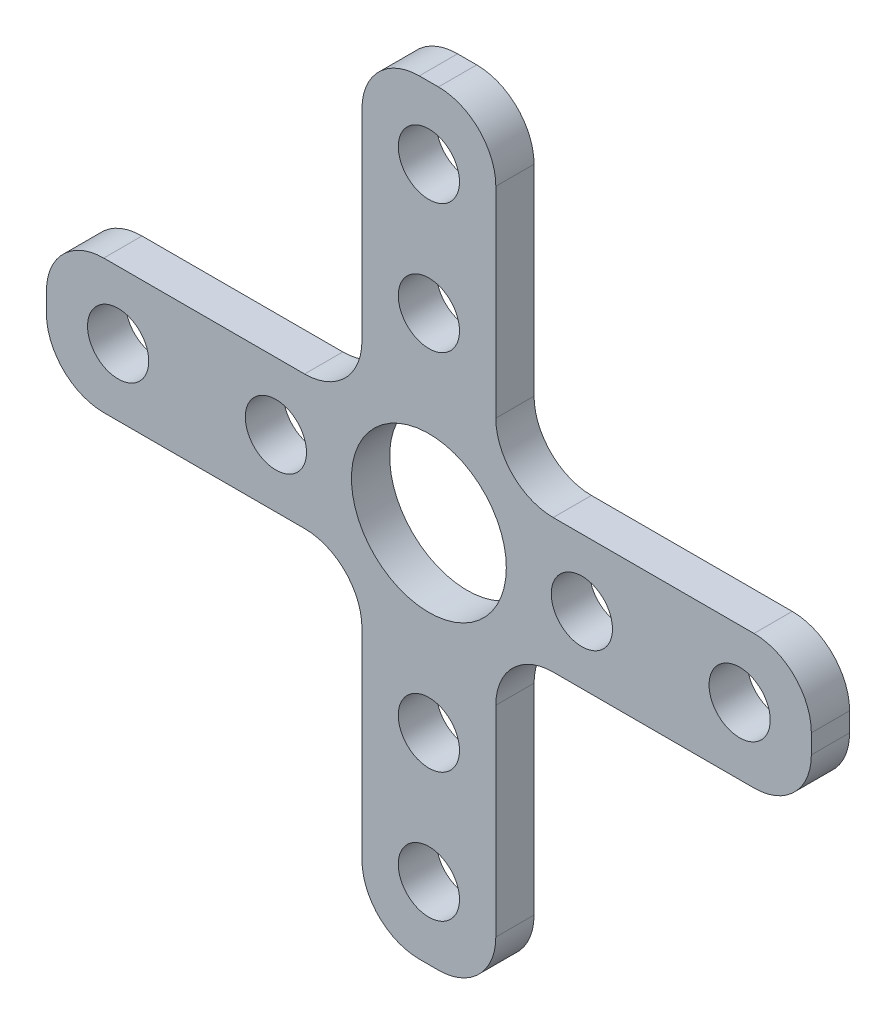
ISO-10303-21;
HEADER;
FILE_DESCRIPTION(('STEP AP214'),'2;1');
FILE_NAME('part.step','',(''),(''),'','','');
FILE_SCHEMA(('AUTOMOTIVE_DESIGN { 1 0 10303 214 1 1 1 1 }'));
ENDSEC;
DATA;
#1=APPLICATION_CONTEXT('core data for automotive mechanical design processes');
#2=APPLICATION_PROTOCOL_DEFINITION('international standard','automotive_design',2000,#1);
#3=PRODUCT_CONTEXT('',#1,'mechanical');
#4=PRODUCT('Part','Part','',(#3));
#5=PRODUCT_RELATED_PRODUCT_CATEGORY('part','',(#4));
#6=PRODUCT_DEFINITION_FORMATION('','',#4);
#7=PRODUCT_DEFINITION_CONTEXT('part definition',#1,'design');
#8=PRODUCT_DEFINITION('design','',#6,#7);
#9=PRODUCT_DEFINITION_SHAPE('','',#8);
#10=(LENGTH_UNIT() NAMED_UNIT(*) SI_UNIT(.MILLI.,.METRE.));
#11=(NAMED_UNIT(*) PLANE_ANGLE_UNIT() SI_UNIT($,.RADIAN.));
#12=(NAMED_UNIT(*) SI_UNIT($,.STERADIAN.) SOLID_ANGLE_UNIT());
#13=UNCERTAINTY_MEASURE_WITH_UNIT(LENGTH_MEASURE(1.E-05),#10,'distance_accuracy_value','');
#14=(GEOMETRIC_REPRESENTATION_CONTEXT(3) GLOBAL_UNCERTAINTY_ASSIGNED_CONTEXT((#13)) GLOBAL_UNIT_ASSIGNED_CONTEXT((#10,
#11,#12)) REPRESENTATION_CONTEXT('',''));
#15=CARTESIAN_POINT('',(0.,0.,0.));
#16=DIRECTION('',(0.,0.,1.));
#17=DIRECTION('',(1.,0.,0.));
#18=AXIS2_PLACEMENT_3D('',#15,#16,#17);
#19=CARTESIAN_POINT('',(0.,0.,1.));
#20=DIRECTION('',(0.,0.,1.));
#21=DIRECTION('',(1.,0.,0.));
#22=AXIS2_PLACEMENT_3D('',#19,#20,#21);
#23=PLANE('',#22);
#24=CARTESIAN_POINT('',(0.,-9.5,1.));
#25=DIRECTION('',(0.,0.,1.));
#26=DIRECTION('',(1.,0.,0.));
#27=AXIS2_PLACEMENT_3D('',#24,#25,#26);
#28=CIRCLE('',#27,1.6);
#29=CARTESIAN_POINT('',(1.6,-9.5,1.));
#30=VERTEX_POINT('',#29);
#31=EDGE_CURVE('E532',#30,#30,#28,.T.);
#32=ORIENTED_EDGE('',*,*,#31,.F.);
#33=EDGE_LOOP('',(#32));
#34=FACE_BOUND('',#33,.T.);
#35=CARTESIAN_POINT('',(0.,9.5,1.));
#36=DIRECTION('',(0.,0.,1.));
#37=DIRECTION('',(1.,0.,0.));
#38=AXIS2_PLACEMENT_3D('',#35,#36,#37);
#39=CIRCLE('',#38,1.6);
#40=CARTESIAN_POINT('',(1.6,9.5,1.));
#41=VERTEX_POINT('',#40);
#42=EDGE_CURVE('E516',#41,#41,#39,.T.);
#43=ORIENTED_EDGE('',*,*,#42,.F.);
#44=EDGE_LOOP('',(#43));
#45=FACE_BOUND('',#44,.T.);
#46=CARTESIAN_POINT('',(0.,-16.25,1.));
#47=DIRECTION('',(0.,0.,1.));
#48=DIRECTION('',(1.,0.,0.));
#49=AXIS2_PLACEMENT_3D('',#46,#47,#48);
#50=CIRCLE('',#49,1.6);
#51=CARTESIAN_POINT('',(1.6,-16.25,1.));
#52=VERTEX_POINT('',#51);
#53=EDGE_CURVE('E500',#52,#52,#50,.T.);
#54=ORIENTED_EDGE('',*,*,#53,.F.);
#55=EDGE_LOOP('',(#54));
#56=FACE_BOUND('',#55,.T.);
#57=CARTESIAN_POINT('',(8.,0.,1.));
#58=DIRECTION('',(0.,0.,1.));
#59=DIRECTION('',(1.,0.,0.));
#60=AXIS2_PLACEMENT_3D('',#57,#58,#59);
#61=CIRCLE('',#60,1.6);
#62=CARTESIAN_POINT('',(9.6,0.,1.));
#63=VERTEX_POINT('',#62);
#64=EDGE_CURVE('E484',#63,#63,#61,.T.);
#65=ORIENTED_EDGE('',*,*,#64,.F.);
#66=EDGE_LOOP('',(#65));
#67=FACE_BOUND('',#66,.T.);
#68=DIRECTION('',(-1.,0.,0.));
#69=VECTOR('',#68,1.);
#70=CARTESIAN_POINT('',(-20.,3.5,1.));
#71=LINE('',#70,#69);
#72=CARTESIAN_POINT('',(-6.5,3.5,1.));
#73=VERTEX_POINT('',#72);
#74=CARTESIAN_POINT('',(-17.,3.5,1.));
#75=VERTEX_POINT('',#74);
#76=EDGE_CURVE('E403',#73,#75,#71,.T.);
#77=ORIENTED_EDGE('',*,*,#76,.T.);
#78=CARTESIAN_POINT('',(-17.,0.499999999999999,1.));
#79=DIRECTION('',(0.,0.,1.));
#80=DIRECTION('',(1.,0.,0.));
#81=AXIS2_PLACEMENT_3D('',#78,#79,#80);
#82=CIRCLE('',#81,3.);
#83=CARTESIAN_POINT('',(-20.,0.499999999999999,1.));
#84=VERTEX_POINT('',#83);
#85=EDGE_CURVE('E297',#75,#84,#82,.T.);
#86=ORIENTED_EDGE('',*,*,#85,.T.);
#87=DIRECTION('',(0.,-1.,0.));
#88=VECTOR('',#87,1.);
#89=CARTESIAN_POINT('',(-20.,-3.5,1.));
#90=LINE('',#89,#88);
#91=CARTESIAN_POINT('',(-20.,-0.500000000000001,1.));
#92=VERTEX_POINT('',#91);
#93=EDGE_CURVE('E222',#84,#92,#90,.T.);
#94=ORIENTED_EDGE('',*,*,#93,.T.);
#95=CARTESIAN_POINT('',(-17.,-0.500000000000001,1.));
#96=DIRECTION('',(0.,0.,1.));
#97=DIRECTION('',(1.,0.,0.));
#98=AXIS2_PLACEMENT_3D('',#95,#96,#97);
#99=CIRCLE('',#98,3.);
#100=CARTESIAN_POINT('',(-17.,-3.5,1.));
#101=VERTEX_POINT('',#100);
#102=EDGE_CURVE('E294',#92,#101,#99,.T.);
#103=ORIENTED_EDGE('',*,*,#102,.T.);
#104=DIRECTION('',(1.,0.,0.));
#105=VECTOR('',#104,1.);
#106=CARTESIAN_POINT('',(-20.,-3.5,1.));
#107=LINE('',#106,#105);
#108=CARTESIAN_POINT('',(-6.5,-3.5,1.));
#109=VERTEX_POINT('',#108);
#110=EDGE_CURVE('E411',#101,#109,#107,.T.);
#111=ORIENTED_EDGE('',*,*,#110,.T.);
#112=CARTESIAN_POINT('',(-6.5,-6.5,1.));
#113=DIRECTION('',(0.,0.,1.));
#114=DIRECTION('',(1.,0.,0.));
#115=AXIS2_PLACEMENT_3D('',#112,#113,#114);
#116=CIRCLE('',#115,3.);
#117=CARTESIAN_POINT('',(-3.5,-6.5,1.));
#118=VERTEX_POINT('',#117);
#119=EDGE_CURVE('E372',#109,#118,#116,.F.);
#120=ORIENTED_EDGE('',*,*,#119,.T.);
#121=DIRECTION('',(0.,-1.,0.));
#122=VECTOR('',#121,1.);
#123=CARTESIAN_POINT('',(-3.5,-3.5,1.));
#124=LINE('',#123,#122);
#125=CARTESIAN_POINT('',(-3.5,-17.,1.));
#126=VERTEX_POINT('',#125);
#127=EDGE_CURVE('E420',#118,#126,#124,.T.);
#128=ORIENTED_EDGE('',*,*,#127,.T.);
#129=CARTESIAN_POINT('',(-0.499999999999997,-17.,1.));
#130=DIRECTION('',(0.,0.,1.));
#131=DIRECTION('',(1.,0.,0.));
#132=AXIS2_PLACEMENT_3D('',#129,#130,#131);
#133=CIRCLE('',#132,3.);
#134=CARTESIAN_POINT('',(-0.499999999999997,-20.,1.));
#135=VERTEX_POINT('',#134);
#136=EDGE_CURVE('E61',#126,#135,#133,.T.);
#137=ORIENTED_EDGE('',*,*,#136,.T.);
#138=DIRECTION('',(1.,0.,0.));
#139=VECTOR('',#138,1.);
#140=CARTESIAN_POINT('',(-3.5,-20.,1.));
#141=LINE('',#140,#139);
#142=CARTESIAN_POINT('',(0.500000000000003,-20.,1.));
#143=VERTEX_POINT('',#142);
#144=EDGE_CURVE('E251',#135,#143,#141,.T.);
#145=ORIENTED_EDGE('',*,*,#144,.T.);
#146=CARTESIAN_POINT('',(0.500000000000003,-17.,1.));
#147=DIRECTION('',(0.,0.,1.));
#148=DIRECTION('',(1.,0.,0.));
#149=AXIS2_PLACEMENT_3D('',#146,#147,#148);
#150=CIRCLE('',#149,3.);
#151=CARTESIAN_POINT('',(3.5,-17.,1.));
#152=VERTEX_POINT('',#151);
#153=EDGE_CURVE('E289',#143,#152,#150,.T.);
#154=ORIENTED_EDGE('',*,*,#153,.T.);
#155=DIRECTION('',(0.,1.,0.));
#156=VECTOR('',#155,1.);
#157=CARTESIAN_POINT('',(3.5,-3.5,1.));
#158=LINE('',#157,#156);
#159=CARTESIAN_POINT('',(3.5,-6.5,1.));
#160=VERTEX_POINT('',#159);
#161=EDGE_CURVE('E249',#152,#160,#158,.T.);
#162=ORIENTED_EDGE('',*,*,#161,.T.);
#163=CARTESIAN_POINT('',(6.5,-6.5,1.));
#164=DIRECTION('',(0.,0.,1.));
#165=DIRECTION('',(1.,0.,0.));
#166=AXIS2_PLACEMENT_3D('',#163,#164,#165);
#167=CIRCLE('',#166,3.);
#168=CARTESIAN_POINT('',(6.5,-3.5,1.));
#169=VERTEX_POINT('',#168);
#170=EDGE_CURVE('E378',#160,#169,#167,.F.);
#171=ORIENTED_EDGE('',*,*,#170,.T.);
#172=DIRECTION('',(1.,0.,0.));
#173=VECTOR('',#172,1.);
#174=CARTESIAN_POINT('',(3.5,-3.5,1.));
#175=LINE('',#174,#173);
#176=CARTESIAN_POINT('',(17.,-3.5,1.));
#177=VERTEX_POINT('',#176);
#178=EDGE_CURVE('E473',#169,#177,#175,.T.);
#179=ORIENTED_EDGE('',*,*,#178,.T.);
#180=CARTESIAN_POINT('',(17.,-0.500000000000001,1.));
#181=DIRECTION('',(0.,0.,1.));
#182=DIRECTION('',(1.,0.,0.));
#183=AXIS2_PLACEMENT_3D('',#180,#181,#182);
#184=CIRCLE('',#183,3.);
#185=CARTESIAN_POINT('',(20.,-0.500000000000001,1.));
#186=VERTEX_POINT('',#185);
#187=EDGE_CURVE('E286',#177,#186,#184,.T.);
#188=ORIENTED_EDGE('',*,*,#187,.T.);
#189=DIRECTION('',(0.,1.,0.));
#190=VECTOR('',#189,1.);
#191=CARTESIAN_POINT('',(20.,-3.5,1.));
#192=LINE('',#191,#190);
#193=CARTESIAN_POINT('',(20.,0.499999999999999,1.));
#194=VERTEX_POINT('',#193);
#195=EDGE_CURVE('E469',#186,#194,#192,.T.);
#196=ORIENTED_EDGE('',*,*,#195,.T.);
#197=CARTESIAN_POINT('',(17.,0.499999999999999,1.));
#198=DIRECTION('',(0.,0.,1.));
#199=DIRECTION('',(1.,0.,0.));
#200=AXIS2_PLACEMENT_3D('',#197,#198,#199);
#201=CIRCLE('',#200,3.);
#202=CARTESIAN_POINT('',(17.,3.5,1.));
#203=VERTEX_POINT('',#202);
#204=EDGE_CURVE('E283',#194,#203,#201,.T.);
#205=ORIENTED_EDGE('',*,*,#204,.T.);
#206=DIRECTION('',(-1.,0.,0.));
#207=VECTOR('',#206,1.);
#208=CARTESIAN_POINT('',(3.5,3.5,1.));
#209=LINE('',#208,#207);
#210=CARTESIAN_POINT('',(6.5,3.5,1.));
#211=VERTEX_POINT('',#210);
#212=EDGE_CURVE('E463',#203,#211,#209,.T.);
#213=ORIENTED_EDGE('',*,*,#212,.T.);
#214=CARTESIAN_POINT('',(6.5,6.5,1.));
#215=DIRECTION('',(0.,0.,1.));
#216=DIRECTION('',(1.,0.,0.));
#217=AXIS2_PLACEMENT_3D('',#214,#215,#216);
#218=CIRCLE('',#217,3.);
#219=CARTESIAN_POINT('',(3.5,6.5,1.));
#220=VERTEX_POINT('',#219);
#221=EDGE_CURVE('E384',#211,#220,#218,.F.);
#222=ORIENTED_EDGE('',*,*,#221,.T.);
#223=DIRECTION('',(0.,1.,0.));
#224=VECTOR('',#223,1.);
#225=CARTESIAN_POINT('',(3.5,20.,1.));
#226=LINE('',#225,#224);
#227=CARTESIAN_POINT('',(3.5,17.,1.));
#228=VERTEX_POINT('',#227);
#229=EDGE_CURVE('E461',#220,#228,#226,.T.);
#230=ORIENTED_EDGE('',*,*,#229,.T.);
#231=CARTESIAN_POINT('',(0.499999999999999,17.,1.));
#232=DIRECTION('',(0.,0.,1.));
#233=DIRECTION('',(1.,0.,0.));
#234=AXIS2_PLACEMENT_3D('',#231,#232,#233);
#235=CIRCLE('',#234,3.);
#236=CARTESIAN_POINT('',(0.499999999999999,20.,1.));
#237=VERTEX_POINT('',#236);
#238=EDGE_CURVE('E280',#228,#237,#235,.T.);
#239=ORIENTED_EDGE('',*,*,#238,.T.);
#240=DIRECTION('',(-1.,0.,0.));
#241=VECTOR('',#240,1.);
#242=CARTESIAN_POINT('',(-3.5,20.,1.));
#243=LINE('',#242,#241);
#244=CARTESIAN_POINT('',(-0.500000000000001,20.,1.));
#245=VERTEX_POINT('',#244);
#246=EDGE_CURVE('E413',#237,#245,#243,.T.);
#247=ORIENTED_EDGE('',*,*,#246,.T.);
#248=CARTESIAN_POINT('',(-0.500000000000001,17.,1.));
#249=DIRECTION('',(0.,0.,1.));
#250=DIRECTION('',(1.,0.,0.));
#251=AXIS2_PLACEMENT_3D('',#248,#249,#250);
#252=CIRCLE('',#251,3.);
#253=CARTESIAN_POINT('',(-3.5,17.,1.));
#254=VERTEX_POINT('',#253);
#255=EDGE_CURVE('E277',#245,#254,#252,.T.);
#256=ORIENTED_EDGE('',*,*,#255,.T.);
#257=DIRECTION('',(0.,-1.,0.));
#258=VECTOR('',#257,1.);
#259=CARTESIAN_POINT('',(-3.5,20.,1.));
#260=LINE('',#259,#258);
#261=CARTESIAN_POINT('',(-3.5,6.5,1.));
#262=VERTEX_POINT('',#261);
#263=EDGE_CURVE('E404',#254,#262,#260,.T.);
#264=ORIENTED_EDGE('',*,*,#263,.T.);
#265=CARTESIAN_POINT('',(-6.5,6.5,1.));
#266=DIRECTION('',(0.,0.,1.));
#267=DIRECTION('',(1.,0.,0.));
#268=AXIS2_PLACEMENT_3D('',#265,#266,#267);
#269=CIRCLE('',#268,3.);
#270=EDGE_CURVE('E11',#262,#73,#269,.F.);
#271=ORIENTED_EDGE('',*,*,#270,.T.);
#272=EDGE_LOOP('',(#77,#86,#94,#103,#111,#120,#128,#137,#145,#154,#162,#171,#179,#188,#196,#205,
#213,#222,#230,#239,#247,#256,#264,#271));
#273=FACE_BOUND('',#272,.T.);
#274=CARTESIAN_POINT('',(-8.,0.,1.));
#275=DIRECTION('',(0.,0.,1.));
#276=DIRECTION('',(1.,0.,0.));
#277=AXIS2_PLACEMENT_3D('',#274,#275,#276);
#278=CIRCLE('',#277,1.6);
#279=CARTESIAN_POINT('',(-6.4,0.,1.));
#280=VERTEX_POINT('',#279);
#281=EDGE_CURVE('E430',#280,#280,#278,.T.);
#282=ORIENTED_EDGE('',*,*,#281,.F.);
#283=EDGE_LOOP('',(#282));
#284=FACE_BOUND('',#283,.T.);
#285=CARTESIAN_POINT('',(0.,16.25,1.));
#286=DIRECTION('',(0.,0.,1.));
#287=DIRECTION('',(1.,0.,0.));
#288=AXIS2_PLACEMENT_3D('',#285,#286,#287);
#289=CIRCLE('',#288,1.6);
#290=CARTESIAN_POINT('',(1.6,16.25,1.));
#291=VERTEX_POINT('',#290);
#292=EDGE_CURVE('E492',#291,#291,#289,.T.);
#293=ORIENTED_EDGE('',*,*,#292,.F.);
#294=EDGE_LOOP('',(#293));
#295=FACE_BOUND('',#294,.T.);
#296=CARTESIAN_POINT('',(0.,0.,1.));
#297=DIRECTION('',(0.,0.,1.));
#298=DIRECTION('',(1.,0.,0.));
#299=AXIS2_PLACEMENT_3D('',#296,#297,#298);
#300=CIRCLE('',#299,4.05);
#301=CARTESIAN_POINT('',(4.05,0.,1.));
#302=VERTEX_POINT('',#301);
#303=EDGE_CURVE('E508',#302,#302,#300,.T.);
#304=ORIENTED_EDGE('',*,*,#303,.F.);
#305=EDGE_LOOP('',(#304));
#306=FACE_BOUND('',#305,.T.);
#307=CARTESIAN_POINT('',(-16.25,0.,1.));
#308=DIRECTION('',(0.,0.,1.));
#309=DIRECTION('',(1.,0.,0.));
#310=AXIS2_PLACEMENT_3D('',#307,#308,#309);
#311=CIRCLE('',#310,1.6);
#312=CARTESIAN_POINT('',(-14.65,0.,1.));
#313=VERTEX_POINT('',#312);
#314=EDGE_CURVE('E524',#313,#313,#311,.T.);
#315=ORIENTED_EDGE('',*,*,#314,.F.);
#316=EDGE_LOOP('',(#315));
#317=FACE_BOUND('',#316,.T.);
#318=CARTESIAN_POINT('',(16.25,0.,1.));
#319=DIRECTION('',(0.,0.,1.));
#320=DIRECTION('',(1.,0.,0.));
#321=AXIS2_PLACEMENT_3D('',#318,#319,#320);
#322=CIRCLE('',#321,1.6);
#323=CARTESIAN_POINT('',(17.85,0.,1.));
#324=VERTEX_POINT('',#323);
#325=EDGE_CURVE('E540',#324,#324,#322,.T.);
#326=ORIENTED_EDGE('',*,*,#325,.F.);
#327=EDGE_LOOP('',(#326));
#328=FACE_BOUND('',#327,.T.);
#329=ADVANCED_FACE('F38',(#34,#45,#56,#67,#273,#284,#295,#306,#317,#328),#23,.T.);
#330=CARTESIAN_POINT('',(0.,0.,-1.));
#331=DIRECTION('',(0.,0.,1.));
#332=DIRECTION('',(1.,0.,0.));
#333=AXIS2_PLACEMENT_3D('',#330,#331,#332);
#334=PLANE('',#333);
#335=DIRECTION('',(0.,-1.,0.));
#336=VECTOR('',#335,1.);
#337=CARTESIAN_POINT('',(-20.,-3.5,-1.));
#338=LINE('',#337,#336);
#339=CARTESIAN_POINT('',(-20.,0.499999999999999,-1.));
#340=VERTEX_POINT('',#339);
#341=CARTESIAN_POINT('',(-20.,-0.500000000000001,-1.));
#342=VERTEX_POINT('',#341);
#343=EDGE_CURVE('E219',#340,#342,#338,.T.);
#344=ORIENTED_EDGE('',*,*,#343,.F.);
#345=CARTESIAN_POINT('',(-17.,0.499999999999999,-1.));
#346=DIRECTION('',(0.,0.,1.));
#347=DIRECTION('',(1.,0.,0.));
#348=AXIS2_PLACEMENT_3D('',#345,#346,#347);
#349=CIRCLE('',#348,3.);
#350=CARTESIAN_POINT('',(-17.,3.5,-1.));
#351=VERTEX_POINT('',#350);
#352=EDGE_CURVE('E201',#340,#351,#349,.F.);
#353=ORIENTED_EDGE('',*,*,#352,.T.);
#354=DIRECTION('',(-1.,0.,0.));
#355=VECTOR('',#354,1.);
#356=CARTESIAN_POINT('',(-20.,3.5,-1.));
#357=LINE('',#356,#355);
#358=CARTESIAN_POINT('',(-6.5,3.5,-1.));
#359=VERTEX_POINT('',#358);
#360=EDGE_CURVE('E232',#359,#351,#357,.T.);
#361=ORIENTED_EDGE('',*,*,#360,.F.);
#362=CARTESIAN_POINT('',(-6.5,6.5,-1.));
#363=DIRECTION('',(0.,0.,1.));
#364=DIRECTION('',(1.,0.,0.));
#365=AXIS2_PLACEMENT_3D('',#362,#363,#364);
#366=CIRCLE('',#365,3.);
#367=CARTESIAN_POINT('',(-3.5,6.5,-1.));
#368=VERTEX_POINT('',#367);
#369=EDGE_CURVE('E47',#359,#368,#366,.T.);
#370=ORIENTED_EDGE('',*,*,#369,.T.);
#371=DIRECTION('',(0.,-1.,0.));
#372=VECTOR('',#371,1.);
#373=CARTESIAN_POINT('',(-3.5,20.,-1.));
#374=LINE('',#373,#372);
#375=CARTESIAN_POINT('',(-3.5,17.,-1.));
#376=VERTEX_POINT('',#375);
#377=EDGE_CURVE('E239',#376,#368,#374,.T.);
#378=ORIENTED_EDGE('',*,*,#377,.F.);
#379=CARTESIAN_POINT('',(-0.500000000000001,17.,-1.));
#380=DIRECTION('',(0.,0.,1.));
#381=DIRECTION('',(1.,0.,0.));
#382=AXIS2_PLACEMENT_3D('',#379,#380,#381);
#383=CIRCLE('',#382,3.);
#384=CARTESIAN_POINT('',(-0.500000000000001,20.,-1.));
#385=VERTEX_POINT('',#384);
#386=EDGE_CURVE('E224',#376,#385,#383,.F.);
#387=ORIENTED_EDGE('',*,*,#386,.T.);
#388=DIRECTION('',(-1.,0.,0.));
#389=VECTOR('',#388,1.);
#390=CARTESIAN_POINT('',(-3.5,20.,-1.));
#391=LINE('',#390,#389);
#392=CARTESIAN_POINT('',(0.499999999999999,20.,-1.));
#393=VERTEX_POINT('',#392);
#394=EDGE_CURVE('E398',#393,#385,#391,.T.);
#395=ORIENTED_EDGE('',*,*,#394,.F.);
#396=CARTESIAN_POINT('',(0.499999999999999,17.,-1.));
#397=DIRECTION('',(0.,0.,1.));
#398=DIRECTION('',(1.,0.,0.));
#399=AXIS2_PLACEMENT_3D('',#396,#397,#398);
#400=CIRCLE('',#399,3.);
#401=CARTESIAN_POINT('',(3.5,17.,-1.));
#402=VERTEX_POINT('',#401);
#403=EDGE_CURVE('E255',#393,#402,#400,.F.);
#404=ORIENTED_EDGE('',*,*,#403,.T.);
#405=DIRECTION('',(0.,1.,0.));
#406=VECTOR('',#405,1.);
#407=CARTESIAN_POINT('',(3.5,20.,-1.));
#408=LINE('',#407,#406);
#409=CARTESIAN_POINT('',(3.5,6.5,-1.));
#410=VERTEX_POINT('',#409);
#411=EDGE_CURVE('E442',#410,#402,#408,.T.);
#412=ORIENTED_EDGE('',*,*,#411,.F.);
#413=CARTESIAN_POINT('',(6.5,6.5,-1.));
#414=DIRECTION('',(0.,0.,1.));
#415=DIRECTION('',(1.,0.,0.));
#416=AXIS2_PLACEMENT_3D('',#413,#414,#415);
#417=CIRCLE('',#416,3.);
#418=CARTESIAN_POINT('',(6.5,3.5,-1.));
#419=VERTEX_POINT('',#418);
#420=EDGE_CURVE('E381',#410,#419,#417,.T.);
#421=ORIENTED_EDGE('',*,*,#420,.T.);
#422=DIRECTION('',(-1.,0.,0.));
#423=VECTOR('',#422,1.);
#424=CARTESIAN_POINT('',(3.5,3.5,-1.));
#425=LINE('',#424,#423);
#426=CARTESIAN_POINT('',(17.,3.5,-1.));
#427=VERTEX_POINT('',#426);
#428=EDGE_CURVE('E438',#427,#419,#425,.T.);
#429=ORIENTED_EDGE('',*,*,#428,.F.);
#430=CARTESIAN_POINT('',(17.,0.499999999999999,-1.));
#431=DIRECTION('',(0.,0.,1.));
#432=DIRECTION('',(1.,0.,0.));
#433=AXIS2_PLACEMENT_3D('',#430,#431,#432);
#434=CIRCLE('',#433,3.);
#435=CARTESIAN_POINT('',(20.,0.499999999999999,-1.));
#436=VERTEX_POINT('',#435);
#437=EDGE_CURVE('E258',#427,#436,#434,.F.);
#438=ORIENTED_EDGE('',*,*,#437,.T.);
#439=DIRECTION('',(0.,1.,0.));
#440=VECTOR('',#439,1.);
#441=CARTESIAN_POINT('',(20.,-3.5,-1.));
#442=LINE('',#441,#440);
#443=CARTESIAN_POINT('',(20.,-0.500000000000001,-1.));
#444=VERTEX_POINT('',#443);
#445=EDGE_CURVE('E434',#444,#436,#442,.T.);
#446=ORIENTED_EDGE('',*,*,#445,.F.);
#447=CARTESIAN_POINT('',(17.,-0.500000000000001,-1.));
#448=DIRECTION('',(0.,0.,1.));
#449=DIRECTION('',(1.,0.,0.));
#450=AXIS2_PLACEMENT_3D('',#447,#448,#449);
#451=CIRCLE('',#450,3.);
#452=CARTESIAN_POINT('',(17.,-3.5,-1.));
#453=VERTEX_POINT('',#452);
#454=EDGE_CURVE('E261',#444,#453,#451,.F.);
#455=ORIENTED_EDGE('',*,*,#454,.T.);
#456=DIRECTION('',(1.,0.,0.));
#457=VECTOR('',#456,1.);
#458=CARTESIAN_POINT('',(3.5,-3.5,-1.));
#459=LINE('',#458,#457);
#460=CARTESIAN_POINT('',(6.5,-3.5,-1.));
#461=VERTEX_POINT('',#460);
#462=EDGE_CURVE('E429',#461,#453,#459,.T.);
#463=ORIENTED_EDGE('',*,*,#462,.F.);
#464=CARTESIAN_POINT('',(6.5,-6.5,-1.));
#465=DIRECTION('',(0.,0.,1.));
#466=DIRECTION('',(1.,0.,0.));
#467=AXIS2_PLACEMENT_3D('',#464,#465,#466);
#468=CIRCLE('',#467,3.);
#469=CARTESIAN_POINT('',(3.5,-6.5,-1.));
#470=VERTEX_POINT('',#469);
#471=EDGE_CURVE('E375',#461,#470,#468,.T.);
#472=ORIENTED_EDGE('',*,*,#471,.T.);
#473=DIRECTION('',(0.,1.,0.));
#474=VECTOR('',#473,1.);
#475=CARTESIAN_POINT('',(3.5,-3.5,-1.));
#476=LINE('',#475,#474);
#477=CARTESIAN_POINT('',(3.5,-17.,-1.));
#478=VERTEX_POINT('',#477);
#479=EDGE_CURVE('E425',#478,#470,#476,.T.);
#480=ORIENTED_EDGE('',*,*,#479,.F.);
#481=CARTESIAN_POINT('',(0.500000000000003,-17.,-1.));
#482=DIRECTION('',(0.,0.,1.));
#483=DIRECTION('',(1.,0.,0.));
#484=AXIS2_PLACEMENT_3D('',#481,#482,#483);
#485=CIRCLE('',#484,3.);
#486=CARTESIAN_POINT('',(0.500000000000003,-20.,-1.));
#487=VERTEX_POINT('',#486);
#488=EDGE_CURVE('E264',#478,#487,#485,.F.);
#489=ORIENTED_EDGE('',*,*,#488,.T.);
#490=DIRECTION('',(1.,0.,0.));
#491=VECTOR('',#490,1.);
#492=CARTESIAN_POINT('',(-3.5,-20.,-1.));
#493=LINE('',#492,#491);
#494=CARTESIAN_POINT('',(-0.499999999999997,-20.,-1.));
#495=VERTEX_POINT('',#494);
#496=EDGE_CURVE('E246',#495,#487,#493,.T.);
#497=ORIENTED_EDGE('',*,*,#496,.F.);
#498=CARTESIAN_POINT('',(-0.499999999999997,-17.,-1.));
#499=DIRECTION('',(0.,0.,1.));
#500=DIRECTION('',(1.,0.,0.));
#501=AXIS2_PLACEMENT_3D('',#498,#499,#500);
#502=CIRCLE('',#501,3.);
#503=CARTESIAN_POINT('',(-3.5,-17.,-1.));
#504=VERTEX_POINT('',#503);
#505=EDGE_CURVE('E267',#495,#504,#502,.F.);
#506=ORIENTED_EDGE('',*,*,#505,.T.);
#507=DIRECTION('',(0.,-1.,0.));
#508=VECTOR('',#507,1.);
#509=CARTESIAN_POINT('',(-3.5,-3.5,-1.));
#510=LINE('',#509,#508);
#511=CARTESIAN_POINT('',(-3.5,-6.5,-1.));
#512=VERTEX_POINT('',#511);
#513=EDGE_CURVE('E237',#512,#504,#510,.T.);
#514=ORIENTED_EDGE('',*,*,#513,.F.);
#515=CARTESIAN_POINT('',(-6.5,-6.5,-1.));
#516=DIRECTION('',(0.,0.,1.));
#517=DIRECTION('',(1.,0.,0.));
#518=AXIS2_PLACEMENT_3D('',#515,#516,#517);
#519=CIRCLE('',#518,3.);
#520=CARTESIAN_POINT('',(-6.5,-3.5,-1.));
#521=VERTEX_POINT('',#520);
#522=EDGE_CURVE('E369',#512,#521,#519,.T.);
#523=ORIENTED_EDGE('',*,*,#522,.T.);
#524=DIRECTION('',(1.,0.,0.));
#525=VECTOR('',#524,1.);
#526=CARTESIAN_POINT('',(-20.,-3.5,-1.));
#527=LINE('',#526,#525);
#528=CARTESIAN_POINT('',(-17.,-3.5,-1.));
#529=VERTEX_POINT('',#528);
#530=EDGE_CURVE('E231',#529,#521,#527,.T.);
#531=ORIENTED_EDGE('',*,*,#530,.F.);
#532=CARTESIAN_POINT('',(-17.,-0.500000000000001,-1.));
#533=DIRECTION('',(0.,0.,1.));
#534=DIRECTION('',(1.,0.,0.));
#535=AXIS2_PLACEMENT_3D('',#532,#533,#534);
#536=CIRCLE('',#535,3.);
#537=EDGE_CURVE('E213',#529,#342,#536,.F.);
#538=ORIENTED_EDGE('',*,*,#537,.T.);
#539=EDGE_LOOP('',(#344,#353,#361,#370,#378,#387,#395,#404,#412,#421,#429,#438,#446,#455,#463,
#472,#480,#489,#497,#506,#514,#523,#531,#538));
#540=FACE_BOUND('',#539,.T.);
#541=CARTESIAN_POINT('',(-8.,0.,-1.));
#542=DIRECTION('',(0.,0.,1.));
#543=DIRECTION('',(1.,0.,0.));
#544=AXIS2_PLACEMENT_3D('',#541,#542,#543);
#545=CIRCLE('',#544,1.6);
#546=CARTESIAN_POINT('',(-6.4,0.,-1.));
#547=VERTEX_POINT('',#546);
#548=EDGE_CURVE('E480',#547,#547,#545,.T.);
#549=ORIENTED_EDGE('',*,*,#548,.T.);
#550=EDGE_LOOP('',(#549));
#551=FACE_BOUND('',#550,.T.);
#552=CARTESIAN_POINT('',(8.,0.,-1.));
#553=DIRECTION('',(0.,0.,1.));
#554=DIRECTION('',(1.,0.,0.));
#555=AXIS2_PLACEMENT_3D('',#552,#553,#554);
#556=CIRCLE('',#555,1.6);
#557=CARTESIAN_POINT('',(9.6,0.,-1.));
#558=VERTEX_POINT('',#557);
#559=EDGE_CURVE('E488',#558,#558,#556,.T.);
#560=ORIENTED_EDGE('',*,*,#559,.T.);
#561=EDGE_LOOP('',(#560));
#562=FACE_BOUND('',#561,.T.);
#563=CARTESIAN_POINT('',(0.,16.25,-1.));
#564=DIRECTION('',(0.,0.,1.));
#565=DIRECTION('',(1.,0.,0.));
#566=AXIS2_PLACEMENT_3D('',#563,#564,#565);
#567=CIRCLE('',#566,1.6);
#568=CARTESIAN_POINT('',(1.6,16.25,-1.));
#569=VERTEX_POINT('',#568);
#570=EDGE_CURVE('E496',#569,#569,#567,.T.);
#571=ORIENTED_EDGE('',*,*,#570,.T.);
#572=EDGE_LOOP('',(#571));
#573=FACE_BOUND('',#572,.T.);
#574=CARTESIAN_POINT('',(0.,-16.25,-1.));
#575=DIRECTION('',(0.,0.,1.));
#576=DIRECTION('',(1.,0.,0.));
#577=AXIS2_PLACEMENT_3D('',#574,#575,#576);
#578=CIRCLE('',#577,1.6);
#579=CARTESIAN_POINT('',(1.6,-16.25,-1.));
#580=VERTEX_POINT('',#579);
#581=EDGE_CURVE('E504',#580,#580,#578,.T.);
#582=ORIENTED_EDGE('',*,*,#581,.T.);
#583=EDGE_LOOP('',(#582));
#584=FACE_BOUND('',#583,.T.);
#585=CARTESIAN_POINT('',(0.,0.,-1.));
#586=DIRECTION('',(0.,0.,1.));
#587=DIRECTION('',(1.,0.,0.));
#588=AXIS2_PLACEMENT_3D('',#585,#586,#587);
#589=CIRCLE('',#588,4.05);
#590=CARTESIAN_POINT('',(4.05,0.,-1.));
#591=VERTEX_POINT('',#590);
#592=EDGE_CURVE('E512',#591,#591,#589,.T.);
#593=ORIENTED_EDGE('',*,*,#592,.T.);
#594=EDGE_LOOP('',(#593));
#595=FACE_BOUND('',#594,.T.);
#596=CARTESIAN_POINT('',(0.,9.5,-1.));
#597=DIRECTION('',(0.,0.,1.));
#598=DIRECTION('',(1.,0.,0.));
#599=AXIS2_PLACEMENT_3D('',#596,#597,#598);
#600=CIRCLE('',#599,1.6);
#601=CARTESIAN_POINT('',(1.6,9.5,-1.));
#602=VERTEX_POINT('',#601);
#603=EDGE_CURVE('E520',#602,#602,#600,.T.);
#604=ORIENTED_EDGE('',*,*,#603,.T.);
#605=EDGE_LOOP('',(#604));
#606=FACE_BOUND('',#605,.T.);
#607=CARTESIAN_POINT('',(-16.25,0.,-1.));
#608=DIRECTION('',(0.,0.,1.));
#609=DIRECTION('',(1.,0.,0.));
#610=AXIS2_PLACEMENT_3D('',#607,#608,#609);
#611=CIRCLE('',#610,1.6);
#612=CARTESIAN_POINT('',(-14.65,0.,-1.));
#613=VERTEX_POINT('',#612);
#614=EDGE_CURVE('E528',#613,#613,#611,.T.);
#615=ORIENTED_EDGE('',*,*,#614,.T.);
#616=EDGE_LOOP('',(#615));
#617=FACE_BOUND('',#616,.T.);
#618=CARTESIAN_POINT('',(0.,-9.5,-1.));
#619=DIRECTION('',(0.,0.,1.));
#620=DIRECTION('',(1.,0.,0.));
#621=AXIS2_PLACEMENT_3D('',#618,#619,#620);
#622=CIRCLE('',#621,1.6);
#623=CARTESIAN_POINT('',(1.6,-9.5,-1.));
#624=VERTEX_POINT('',#623);
#625=EDGE_CURVE('E536',#624,#624,#622,.T.);
#626=ORIENTED_EDGE('',*,*,#625,.T.);
#627=EDGE_LOOP('',(#626));
#628=FACE_BOUND('',#627,.T.);
#629=CARTESIAN_POINT('',(16.25,0.,-1.));
#630=DIRECTION('',(0.,0.,1.));
#631=DIRECTION('',(1.,0.,0.));
#632=AXIS2_PLACEMENT_3D('',#629,#630,#631);
#633=CIRCLE('',#632,1.6);
#634=CARTESIAN_POINT('',(17.85,0.,-1.));
#635=VERTEX_POINT('',#634);
#636=EDGE_CURVE('E544',#635,#635,#633,.T.);
#637=ORIENTED_EDGE('',*,*,#636,.T.);
#638=EDGE_LOOP('',(#637));
#639=FACE_BOUND('',#638,.T.);
#640=ADVANCED_FACE('F227',(#540,#551,#562,#573,#584,#595,#606,#617,#628,#639),#334,.F.);
#641=CARTESIAN_POINT('',(3.5,-3.5,1.));
#642=DIRECTION('',(-1.,0.,0.));
#643=DIRECTION('',(0.,-1.,0.));
#644=AXIS2_PLACEMENT_3D('',#641,#642,#643);
#645=PLANE('',#644);
#646=ORIENTED_EDGE('',*,*,#161,.F.);
#647=DIRECTION('',(0.,0.,-1.));
#648=VECTOR('',#647,1.);
#649=CARTESIAN_POINT('',(3.5,-17.,1.));
#650=LINE('',#649,#648);
#651=EDGE_CURVE('E323',#152,#478,#650,.T.);
#652=ORIENTED_EDGE('',*,*,#651,.T.);
#653=ORIENTED_EDGE('',*,*,#479,.T.);
#654=DIRECTION('',(0.,0.,-1.));
#655=VECTOR('',#654,1.);
#656=CARTESIAN_POINT('',(3.5,-6.5,1.));
#657=LINE('',#656,#655);
#658=EDGE_CURVE('E320',#470,#160,#657,.F.);
#659=ORIENTED_EDGE('',*,*,#658,.T.);
#660=EDGE_LOOP('',(#646,#652,#653,#659));
#661=FACE_BOUND('',#660,.T.);
#662=ADVANCED_FACE('F562',(#661),#645,.F.);
#663=CARTESIAN_POINT('',(3.5,-3.5,1.));
#664=DIRECTION('',(0.,1.,0.));
#665=DIRECTION('',(-1.,0.,0.));
#666=AXIS2_PLACEMENT_3D('',#663,#664,#665);
#667=PLANE('',#666);
#668=ORIENTED_EDGE('',*,*,#178,.F.);
#669=DIRECTION('',(0.,0.,-1.));
#670=VECTOR('',#669,1.);
#671=CARTESIAN_POINT('',(6.5,-3.5,-1.));
#672=LINE('',#671,#670);
#673=EDGE_CURVE('E330',#169,#461,#672,.T.);
#674=ORIENTED_EDGE('',*,*,#673,.T.);
#675=ORIENTED_EDGE('',*,*,#462,.T.);
#676=DIRECTION('',(0.,0.,-1.));
#677=VECTOR('',#676,1.);
#678=CARTESIAN_POINT('',(17.,-3.5,1.));
#679=LINE('',#678,#677);
#680=EDGE_CURVE('E327',#453,#177,#679,.F.);
#681=ORIENTED_EDGE('',*,*,#680,.T.);
#682=EDGE_LOOP('',(#668,#674,#675,#681));
#683=FACE_BOUND('',#682,.T.);
#684=ADVANCED_FACE('F600',(#683),#667,.F.);
#685=CARTESIAN_POINT('',(20.,-3.5,1.));
#686=DIRECTION('',(-1.,0.,0.));
#687=DIRECTION('',(0.,0.,1.));
#688=AXIS2_PLACEMENT_3D('',#685,#686,#687);
#689=PLANE('',#688);
#690=ORIENTED_EDGE('',*,*,#195,.F.);
#691=DIRECTION('',(0.,0.,-1.));
#692=VECTOR('',#691,1.);
#693=CARTESIAN_POINT('',(20.,-0.500000000000001,1.));
#694=LINE('',#693,#692);
#695=EDGE_CURVE('E337',#186,#444,#694,.T.);
#696=ORIENTED_EDGE('',*,*,#695,.T.);
#697=ORIENTED_EDGE('',*,*,#445,.T.);
#698=DIRECTION('',(0.,0.,-1.));
#699=VECTOR('',#698,1.);
#700=CARTESIAN_POINT('',(20.,0.499999999999999,1.));
#701=LINE('',#700,#699);
#702=EDGE_CURVE('E334',#436,#194,#701,.F.);
#703=ORIENTED_EDGE('',*,*,#702,.T.);
#704=EDGE_LOOP('',(#690,#696,#697,#703));
#705=FACE_BOUND('',#704,.T.);
#706=ADVANCED_FACE('F596',(#705),#689,.F.);
#707=CARTESIAN_POINT('',(3.5,3.5,1.));
#708=DIRECTION('',(0.,-1.,0.));
#709=DIRECTION('',(1.,0.,0.));
#710=AXIS2_PLACEMENT_3D('',#707,#708,#709);
#711=PLANE('',#710);
#712=ORIENTED_EDGE('',*,*,#212,.F.);
#713=DIRECTION('',(0.,0.,-1.));
#714=VECTOR('',#713,1.);
#715=CARTESIAN_POINT('',(17.,3.5,1.));
#716=LINE('',#715,#714);
#717=EDGE_CURVE('E344',#203,#427,#716,.T.);
#718=ORIENTED_EDGE('',*,*,#717,.T.);
#719=ORIENTED_EDGE('',*,*,#428,.T.);
#720=DIRECTION('',(0.,0.,-1.));
#721=VECTOR('',#720,1.);
#722=CARTESIAN_POINT('',(6.5,3.5,1.));
#723=LINE('',#722,#721);
#724=EDGE_CURVE('E341',#419,#211,#723,.F.);
#725=ORIENTED_EDGE('',*,*,#724,.T.);
#726=EDGE_LOOP('',(#712,#718,#719,#725));
#727=FACE_BOUND('',#726,.T.);
#728=ADVANCED_FACE('F592',(#727),#711,.F.);
#729=CARTESIAN_POINT('',(3.5,20.,1.));
#730=DIRECTION('',(-1.,0.,0.));
#731=DIRECTION('',(0.,-1.,0.));
#732=AXIS2_PLACEMENT_3D('',#729,#730,#731);
#733=PLANE('',#732);
#734=ORIENTED_EDGE('',*,*,#229,.F.);
#735=DIRECTION('',(0.,0.,-1.));
#736=VECTOR('',#735,1.);
#737=CARTESIAN_POINT('',(3.5,6.5,-1.));
#738=LINE('',#737,#736);
#739=EDGE_CURVE('E351',#220,#410,#738,.T.);
#740=ORIENTED_EDGE('',*,*,#739,.T.);
#741=ORIENTED_EDGE('',*,*,#411,.T.);
#742=DIRECTION('',(0.,0.,-1.));
#743=VECTOR('',#742,1.);
#744=CARTESIAN_POINT('',(3.5,17.,1.));
#745=LINE('',#744,#743);
#746=EDGE_CURVE('E348',#402,#228,#745,.F.);
#747=ORIENTED_EDGE('',*,*,#746,.T.);
#748=EDGE_LOOP('',(#734,#740,#741,#747));
#749=FACE_BOUND('',#748,.T.);
#750=ADVANCED_FACE('F589',(#749),#733,.F.);
#751=CARTESIAN_POINT('',(-3.5,20.,1.));
#752=DIRECTION('',(0.,-1.,0.));
#753=DIRECTION('',(0.,0.,-1.));
#754=AXIS2_PLACEMENT_3D('',#751,#752,#753);
#755=PLANE('',#754);
#756=ORIENTED_EDGE('',*,*,#246,.F.);
#757=DIRECTION('',(0.,0.,-1.));
#758=VECTOR('',#757,1.);
#759=CARTESIAN_POINT('',(0.499999999999999,20.,1.));
#760=LINE('',#759,#758);
#761=EDGE_CURVE('E358',#237,#393,#760,.T.);
#762=ORIENTED_EDGE('',*,*,#761,.T.);
#763=ORIENTED_EDGE('',*,*,#394,.T.);
#764=DIRECTION('',(0.,0.,-1.));
#765=VECTOR('',#764,1.);
#766=CARTESIAN_POINT('',(-0.500000000000001,20.,1.));
#767=LINE('',#766,#765);
#768=EDGE_CURVE('E355',#385,#245,#767,.F.);
#769=ORIENTED_EDGE('',*,*,#768,.T.);
#770=EDGE_LOOP('',(#756,#762,#763,#769));
#771=FACE_BOUND('',#770,.T.);
#772=ADVANCED_FACE('F452',(#771),#755,.F.);
#773=CARTESIAN_POINT('',(-3.5,20.,1.));
#774=DIRECTION('',(1.,0.,0.));
#775=DIRECTION('',(0.,1.,0.));
#776=AXIS2_PLACEMENT_3D('',#773,#774,#775);
#777=PLANE('',#776);
#778=ORIENTED_EDGE('',*,*,#263,.F.);
#779=DIRECTION('',(0.,0.,-1.));
#780=VECTOR('',#779,1.);
#781=CARTESIAN_POINT('',(-3.5,17.,1.));
#782=LINE('',#781,#780);
#783=EDGE_CURVE('E365',#254,#376,#782,.T.);
#784=ORIENTED_EDGE('',*,*,#783,.T.);
#785=ORIENTED_EDGE('',*,*,#377,.T.);
#786=DIRECTION('',(0.,0.,-1.));
#787=VECTOR('',#786,1.);
#788=CARTESIAN_POINT('',(-3.5,6.5,1.));
#789=LINE('',#788,#787);
#790=EDGE_CURVE('E362',#368,#262,#789,.F.);
#791=ORIENTED_EDGE('',*,*,#790,.T.);
#792=EDGE_LOOP('',(#778,#784,#785,#791));
#793=FACE_BOUND('',#792,.T.);
#794=ADVANCED_FACE('F394',(#793),#777,.F.);
#795=CARTESIAN_POINT('',(-20.,3.5,1.));
#796=DIRECTION('',(0.,-1.,0.));
#797=DIRECTION('',(1.,0.,0.));
#798=AXIS2_PLACEMENT_3D('',#795,#796,#797);
#799=PLANE('',#798);
#800=ORIENTED_EDGE('',*,*,#360,.T.);
#801=DIRECTION('',(0.,0.,-1.));
#802=VECTOR('',#801,1.);
#803=CARTESIAN_POINT('',(-17.,3.5,1.));
#804=LINE('',#803,#802);
#805=EDGE_CURVE('E206',#351,#75,#804,.F.);
#806=ORIENTED_EDGE('',*,*,#805,.T.);
#807=ORIENTED_EDGE('',*,*,#76,.F.);
#808=DIRECTION('',(0.,0.,-1.));
#809=VECTOR('',#808,1.);
#810=CARTESIAN_POINT('',(-6.5,3.5,-1.));
#811=LINE('',#810,#809);
#812=EDGE_CURVE('E212',#73,#359,#811,.T.);
#813=ORIENTED_EDGE('',*,*,#812,.T.);
#814=EDGE_LOOP('',(#800,#806,#807,#813));
#815=FACE_BOUND('',#814,.T.);
#816=ADVANCED_FACE('F406',(#815),#799,.F.);
#817=CARTESIAN_POINT('',(-20.,-3.5,1.));
#818=DIRECTION('',(1.,0.,0.));
#819=DIRECTION('',(0.,0.,-1.));
#820=AXIS2_PLACEMENT_3D('',#817,#818,#819);
#821=PLANE('',#820);
#822=ORIENTED_EDGE('',*,*,#93,.F.);
#823=DIRECTION('',(0.,0.,-1.));
#824=VECTOR('',#823,1.);
#825=CARTESIAN_POINT('',(-20.,0.499999999999999,1.));
#826=LINE('',#825,#824);
#827=EDGE_CURVE('E205',#84,#340,#826,.T.);
#828=ORIENTED_EDGE('',*,*,#827,.T.);
#829=ORIENTED_EDGE('',*,*,#343,.T.);
#830=DIRECTION('',(0.,0.,-1.));
#831=VECTOR('',#830,1.);
#832=CARTESIAN_POINT('',(-20.,-0.500000000000001,1.));
#833=LINE('',#832,#831);
#834=EDGE_CURVE('E225',#342,#92,#833,.F.);
#835=ORIENTED_EDGE('',*,*,#834,.T.);
#836=EDGE_LOOP('',(#822,#828,#829,#835));
#837=FACE_BOUND('',#836,.T.);
#838=ADVANCED_FACE('F218',(#837),#821,.F.);
#839=CARTESIAN_POINT('',(-20.,-3.5,1.));
#840=DIRECTION('',(0.,1.,0.));
#841=DIRECTION('',(-1.,0.,0.));
#842=AXIS2_PLACEMENT_3D('',#839,#840,#841);
#843=PLANE('',#842);
#844=ORIENTED_EDGE('',*,*,#110,.F.);
#845=DIRECTION('',(0.,0.,-1.));
#846=VECTOR('',#845,1.);
#847=CARTESIAN_POINT('',(-17.,-3.5,1.));
#848=LINE('',#847,#846);
#849=EDGE_CURVE('E303',#101,#529,#848,.T.);
#850=ORIENTED_EDGE('',*,*,#849,.T.);
#851=ORIENTED_EDGE('',*,*,#530,.T.);
#852=DIRECTION('',(0.,0.,-1.));
#853=VECTOR('',#852,1.);
#854=CARTESIAN_POINT('',(-6.5,-3.5,1.));
#855=LINE('',#854,#853);
#856=EDGE_CURVE('E300',#521,#109,#855,.F.);
#857=ORIENTED_EDGE('',*,*,#856,.T.);
#858=EDGE_LOOP('',(#844,#850,#851,#857));
#859=FACE_BOUND('',#858,.T.);
#860=ADVANCED_FACE('F576',(#859),#843,.F.);
#861=CARTESIAN_POINT('',(-3.5,-3.5,1.));
#862=DIRECTION('',(1.,0.,0.));
#863=DIRECTION('',(0.,1.,0.));
#864=AXIS2_PLACEMENT_3D('',#861,#862,#863);
#865=PLANE('',#864);
#866=ORIENTED_EDGE('',*,*,#127,.F.);
#867=DIRECTION('',(0.,0.,-1.));
#868=VECTOR('',#867,1.);
#869=CARTESIAN_POINT('',(-3.5,-6.5,-1.));
#870=LINE('',#869,#868);
#871=EDGE_CURVE('E310',#118,#512,#870,.T.);
#872=ORIENTED_EDGE('',*,*,#871,.T.);
#873=ORIENTED_EDGE('',*,*,#513,.T.);
#874=DIRECTION('',(0.,0.,-1.));
#875=VECTOR('',#874,1.);
#876=CARTESIAN_POINT('',(-3.5,-17.,1.));
#877=LINE('',#876,#875);
#878=EDGE_CURVE('E307',#504,#126,#877,.F.);
#879=ORIENTED_EDGE('',*,*,#878,.T.);
#880=EDGE_LOOP('',(#866,#872,#873,#879));
#881=FACE_BOUND('',#880,.T.);
#882=ADVANCED_FACE('F573',(#881),#865,.F.);
#883=CARTESIAN_POINT('',(-3.5,-20.,1.));
#884=DIRECTION('',(0.,1.,0.));
#885=DIRECTION('',(0.,0.,1.));
#886=AXIS2_PLACEMENT_3D('',#883,#884,#885);
#887=PLANE('',#886);
#888=ORIENTED_EDGE('',*,*,#144,.F.);
#889=DIRECTION('',(0.,0.,-1.));
#890=VECTOR('',#889,1.);
#891=CARTESIAN_POINT('',(-0.499999999999997,-20.,1.));
#892=LINE('',#891,#890);
#893=EDGE_CURVE('E316',#135,#495,#892,.T.);
#894=ORIENTED_EDGE('',*,*,#893,.T.);
#895=ORIENTED_EDGE('',*,*,#496,.T.);
#896=DIRECTION('',(0.,0.,-1.));
#897=VECTOR('',#896,1.);
#898=CARTESIAN_POINT('',(0.500000000000003,-20.,1.));
#899=LINE('',#898,#897);
#900=EDGE_CURVE('E54',#487,#143,#899,.F.);
#901=ORIENTED_EDGE('',*,*,#900,.T.);
#902=EDGE_LOOP('',(#888,#894,#895,#901));
#903=FACE_BOUND('',#902,.T.);
#904=ADVANCED_FACE('F570',(#903),#887,.F.);
#905=CARTESIAN_POINT('',(-8.,0.,1.));
#906=DIRECTION('',(0.,0.,-1.));
#907=DIRECTION('',(-1.,0.,0.));
#908=AXIS2_PLACEMENT_3D('',#905,#906,#907);
#909=CYLINDRICAL_SURFACE('',#908,1.6);
#910=ORIENTED_EDGE('',*,*,#281,.T.);
#911=EDGE_LOOP('',(#910));
#912=FACE_BOUND('',#911,.T.);
#913=ORIENTED_EDGE('',*,*,#548,.F.);
#914=EDGE_LOOP('',(#913));
#915=FACE_BOUND('',#914,.T.);
#916=ADVANCED_FACE('F567',(#912,#915),#909,.F.);
#917=CARTESIAN_POINT('',(8.,0.,1.));
#918=DIRECTION('',(0.,0.,-1.));
#919=DIRECTION('',(-1.,0.,0.));
#920=AXIS2_PLACEMENT_3D('',#917,#918,#919);
#921=CYLINDRICAL_SURFACE('',#920,1.6);
#922=ORIENTED_EDGE('',*,*,#64,.T.);
#923=EDGE_LOOP('',(#922));
#924=FACE_BOUND('',#923,.T.);
#925=ORIENTED_EDGE('',*,*,#559,.F.);
#926=EDGE_LOOP('',(#925));
#927=FACE_BOUND('',#926,.T.);
#928=ADVANCED_FACE('F809',(#924,#927),#921,.F.);
#929=CARTESIAN_POINT('',(0.,16.25,1.));
#930=DIRECTION('',(0.,0.,-1.));
#931=DIRECTION('',(-1.,0.,0.));
#932=AXIS2_PLACEMENT_3D('',#929,#930,#931);
#933=CYLINDRICAL_SURFACE('',#932,1.6);
#934=ORIENTED_EDGE('',*,*,#292,.T.);
#935=EDGE_LOOP('',(#934));
#936=FACE_BOUND('',#935,.T.);
#937=ORIENTED_EDGE('',*,*,#570,.F.);
#938=EDGE_LOOP('',(#937));
#939=FACE_BOUND('',#938,.T.);
#940=ADVANCED_FACE('F817',(#936,#939),#933,.F.);
#941=CARTESIAN_POINT('',(0.,-16.25,1.));
#942=DIRECTION('',(0.,0.,-1.));
#943=DIRECTION('',(-1.,0.,0.));
#944=AXIS2_PLACEMENT_3D('',#941,#942,#943);
#945=CYLINDRICAL_SURFACE('',#944,1.6);
#946=ORIENTED_EDGE('',*,*,#53,.T.);
#947=EDGE_LOOP('',(#946));
#948=FACE_BOUND('',#947,.T.);
#949=ORIENTED_EDGE('',*,*,#581,.F.);
#950=EDGE_LOOP('',(#949));
#951=FACE_BOUND('',#950,.T.);
#952=ADVANCED_FACE('F825',(#948,#951),#945,.F.);
#953=CARTESIAN_POINT('',(0.,0.,1.));
#954=DIRECTION('',(0.,0.,-1.));
#955=DIRECTION('',(-1.,0.,0.));
#956=AXIS2_PLACEMENT_3D('',#953,#954,#955);
#957=CYLINDRICAL_SURFACE('',#956,4.05);
#958=ORIENTED_EDGE('',*,*,#303,.T.);
#959=EDGE_LOOP('',(#958));
#960=FACE_BOUND('',#959,.T.);
#961=ORIENTED_EDGE('',*,*,#592,.F.);
#962=EDGE_LOOP('',(#961));
#963=FACE_BOUND('',#962,.T.);
#964=ADVANCED_FACE('F834',(#960,#963),#957,.F.);
#965=CARTESIAN_POINT('',(0.,9.5,1.));
#966=DIRECTION('',(0.,0.,-1.));
#967=DIRECTION('',(-1.,0.,0.));
#968=AXIS2_PLACEMENT_3D('',#965,#966,#967);
#969=CYLINDRICAL_SURFACE('',#968,1.6);
#970=ORIENTED_EDGE('',*,*,#42,.T.);
#971=EDGE_LOOP('',(#970));
#972=FACE_BOUND('',#971,.T.);
#973=ORIENTED_EDGE('',*,*,#603,.F.);
#974=EDGE_LOOP('',(#973));
#975=FACE_BOUND('',#974,.T.);
#976=ADVANCED_FACE('F843',(#972,#975),#969,.F.);
#977=CARTESIAN_POINT('',(-16.25,0.,1.));
#978=DIRECTION('',(0.,0.,-1.));
#979=DIRECTION('',(-1.,0.,0.));
#980=AXIS2_PLACEMENT_3D('',#977,#978,#979);
#981=CYLINDRICAL_SURFACE('',#980,1.6);
#982=ORIENTED_EDGE('',*,*,#314,.T.);
#983=EDGE_LOOP('',(#982));
#984=FACE_BOUND('',#983,.T.);
#985=ORIENTED_EDGE('',*,*,#614,.F.);
#986=EDGE_LOOP('',(#985));
#987=FACE_BOUND('',#986,.T.);
#988=ADVANCED_FACE('F852',(#984,#987),#981,.F.);
#989=CARTESIAN_POINT('',(0.,-9.5,1.));
#990=DIRECTION('',(0.,0.,-1.));
#991=DIRECTION('',(-1.,0.,0.));
#992=AXIS2_PLACEMENT_3D('',#989,#990,#991);
#993=CYLINDRICAL_SURFACE('',#992,1.6);
#994=ORIENTED_EDGE('',*,*,#31,.T.);
#995=EDGE_LOOP('',(#994));
#996=FACE_BOUND('',#995,.T.);
#997=ORIENTED_EDGE('',*,*,#625,.F.);
#998=EDGE_LOOP('',(#997));
#999=FACE_BOUND('',#998,.T.);
#1000=ADVANCED_FACE('F861',(#996,#999),#993,.F.);
#1001=CARTESIAN_POINT('',(16.25,0.,1.));
#1002=DIRECTION('',(0.,0.,-1.));
#1003=DIRECTION('',(-1.,0.,0.));
#1004=AXIS2_PLACEMENT_3D('',#1001,#1002,#1003);
#1005=CYLINDRICAL_SURFACE('',#1004,1.6);
#1006=ORIENTED_EDGE('',*,*,#325,.T.);
#1007=EDGE_LOOP('',(#1006));
#1008=FACE_BOUND('',#1007,.T.);
#1009=ORIENTED_EDGE('',*,*,#636,.F.);
#1010=EDGE_LOOP('',(#1009));
#1011=FACE_BOUND('',#1010,.T.);
#1012=ADVANCED_FACE('F552',(#1008,#1011),#1005,.F.);
#1013=CARTESIAN_POINT('',(-17.,0.499999999999999,1.));
#1014=DIRECTION('',(0.,0.,-1.));
#1015=DIRECTION('',(-1.,0.,0.));
#1016=AXIS2_PLACEMENT_3D('',#1013,#1014,#1015);
#1017=CYLINDRICAL_SURFACE('',#1016,3.);
#1018=ORIENTED_EDGE('',*,*,#85,.F.);
#1019=ORIENTED_EDGE('',*,*,#805,.F.);
#1020=ORIENTED_EDGE('',*,*,#352,.F.);
#1021=ORIENTED_EDGE('',*,*,#827,.F.);
#1022=EDGE_LOOP('',(#1018,#1019,#1020,#1021));
#1023=FACE_BOUND('',#1022,.T.);
#1024=ADVANCED_FACE('F204',(#1023),#1017,.T.);
#1025=CARTESIAN_POINT('',(-17.,-0.500000000000001,1.));
#1026=DIRECTION('',(0.,0.,-1.));
#1027=DIRECTION('',(-1.,0.,0.));
#1028=AXIS2_PLACEMENT_3D('',#1025,#1026,#1027);
#1029=CYLINDRICAL_SURFACE('',#1028,3.);
#1030=ORIENTED_EDGE('',*,*,#102,.F.);
#1031=ORIENTED_EDGE('',*,*,#834,.F.);
#1032=ORIENTED_EDGE('',*,*,#537,.F.);
#1033=ORIENTED_EDGE('',*,*,#849,.F.);
#1034=EDGE_LOOP('',(#1030,#1031,#1032,#1033));
#1035=FACE_BOUND('',#1034,.T.);
#1036=ADVANCED_FACE('F610',(#1035),#1029,.T.);
#1037=CARTESIAN_POINT('',(-6.5,-6.5,1.));
#1038=DIRECTION('',(0.,0.,1.));
#1039=DIRECTION('',(1.,0.,0.));
#1040=AXIS2_PLACEMENT_3D('',#1037,#1038,#1039);
#1041=CYLINDRICAL_SURFACE('',#1040,3.);
#1042=ORIENTED_EDGE('',*,*,#119,.F.);
#1043=ORIENTED_EDGE('',*,*,#856,.F.);
#1044=ORIENTED_EDGE('',*,*,#522,.F.);
#1045=ORIENTED_EDGE('',*,*,#871,.F.);
#1046=EDGE_LOOP('',(#1042,#1043,#1044,#1045));
#1047=FACE_BOUND('',#1046,.T.);
#1048=ADVANCED_FACE('F613',(#1047),#1041,.F.);
#1049=CARTESIAN_POINT('',(-0.499999999999997,-17.,1.));
#1050=DIRECTION('',(0.,0.,-1.));
#1051=DIRECTION('',(-1.,0.,0.));
#1052=AXIS2_PLACEMENT_3D('',#1049,#1050,#1051);
#1053=CYLINDRICAL_SURFACE('',#1052,3.);
#1054=ORIENTED_EDGE('',*,*,#136,.F.);
#1055=ORIENTED_EDGE('',*,*,#878,.F.);
#1056=ORIENTED_EDGE('',*,*,#505,.F.);
#1057=ORIENTED_EDGE('',*,*,#893,.F.);
#1058=EDGE_LOOP('',(#1054,#1055,#1056,#1057));
#1059=FACE_BOUND('',#1058,.T.);
#1060=ADVANCED_FACE('F617',(#1059),#1053,.T.);
#1061=CARTESIAN_POINT('',(0.500000000000003,-17.,1.));
#1062=DIRECTION('',(0.,0.,-1.));
#1063=DIRECTION('',(-1.,0.,0.));
#1064=AXIS2_PLACEMENT_3D('',#1061,#1062,#1063);
#1065=CYLINDRICAL_SURFACE('',#1064,3.);
#1066=ORIENTED_EDGE('',*,*,#153,.F.);
#1067=ORIENTED_EDGE('',*,*,#900,.F.);
#1068=ORIENTED_EDGE('',*,*,#488,.F.);
#1069=ORIENTED_EDGE('',*,*,#651,.F.);
#1070=EDGE_LOOP('',(#1066,#1067,#1068,#1069));
#1071=FACE_BOUND('',#1070,.T.);
#1072=ADVANCED_FACE('F621',(#1071),#1065,.T.);
#1073=CARTESIAN_POINT('',(6.5,-6.5,1.));
#1074=DIRECTION('',(0.,0.,1.));
#1075=DIRECTION('',(1.,0.,0.));
#1076=AXIS2_PLACEMENT_3D('',#1073,#1074,#1075);
#1077=CYLINDRICAL_SURFACE('',#1076,3.);
#1078=ORIENTED_EDGE('',*,*,#170,.F.);
#1079=ORIENTED_EDGE('',*,*,#658,.F.);
#1080=ORIENTED_EDGE('',*,*,#471,.F.);
#1081=ORIENTED_EDGE('',*,*,#673,.F.);
#1082=EDGE_LOOP('',(#1078,#1079,#1080,#1081));
#1083=FACE_BOUND('',#1082,.T.);
#1084=ADVANCED_FACE('F625',(#1083),#1077,.F.);
#1085=CARTESIAN_POINT('',(17.,-0.500000000000001,1.));
#1086=DIRECTION('',(0.,0.,-1.));
#1087=DIRECTION('',(-1.,0.,0.));
#1088=AXIS2_PLACEMENT_3D('',#1085,#1086,#1087);
#1089=CYLINDRICAL_SURFACE('',#1088,3.);
#1090=ORIENTED_EDGE('',*,*,#187,.F.);
#1091=ORIENTED_EDGE('',*,*,#680,.F.);
#1092=ORIENTED_EDGE('',*,*,#454,.F.);
#1093=ORIENTED_EDGE('',*,*,#695,.F.);
#1094=EDGE_LOOP('',(#1090,#1091,#1092,#1093));
#1095=FACE_BOUND('',#1094,.T.);
#1096=ADVANCED_FACE('F629',(#1095),#1089,.T.);
#1097=CARTESIAN_POINT('',(17.,0.499999999999999,1.));
#1098=DIRECTION('',(0.,0.,-1.));
#1099=DIRECTION('',(-1.,0.,0.));
#1100=AXIS2_PLACEMENT_3D('',#1097,#1098,#1099);
#1101=CYLINDRICAL_SURFACE('',#1100,3.);
#1102=ORIENTED_EDGE('',*,*,#204,.F.);
#1103=ORIENTED_EDGE('',*,*,#702,.F.);
#1104=ORIENTED_EDGE('',*,*,#437,.F.);
#1105=ORIENTED_EDGE('',*,*,#717,.F.);
#1106=EDGE_LOOP('',(#1102,#1103,#1104,#1105));
#1107=FACE_BOUND('',#1106,.T.);
#1108=ADVANCED_FACE('F633',(#1107),#1101,.T.);
#1109=CARTESIAN_POINT('',(6.5,6.5,1.));
#1110=DIRECTION('',(0.,0.,1.));
#1111=DIRECTION('',(1.,0.,0.));
#1112=AXIS2_PLACEMENT_3D('',#1109,#1110,#1111);
#1113=CYLINDRICAL_SURFACE('',#1112,3.);
#1114=ORIENTED_EDGE('',*,*,#221,.F.);
#1115=ORIENTED_EDGE('',*,*,#724,.F.);
#1116=ORIENTED_EDGE('',*,*,#420,.F.);
#1117=ORIENTED_EDGE('',*,*,#739,.F.);
#1118=EDGE_LOOP('',(#1114,#1115,#1116,#1117));
#1119=FACE_BOUND('',#1118,.T.);
#1120=ADVANCED_FACE('F637',(#1119),#1113,.F.);
#1121=CARTESIAN_POINT('',(0.499999999999999,17.,1.));
#1122=DIRECTION('',(0.,0.,-1.));
#1123=DIRECTION('',(-1.,0.,0.));
#1124=AXIS2_PLACEMENT_3D('',#1121,#1122,#1123);
#1125=CYLINDRICAL_SURFACE('',#1124,3.);
#1126=ORIENTED_EDGE('',*,*,#238,.F.);
#1127=ORIENTED_EDGE('',*,*,#746,.F.);
#1128=ORIENTED_EDGE('',*,*,#403,.F.);
#1129=ORIENTED_EDGE('',*,*,#761,.F.);
#1130=EDGE_LOOP('',(#1126,#1127,#1128,#1129));
#1131=FACE_BOUND('',#1130,.T.);
#1132=ADVANCED_FACE('F641',(#1131),#1125,.T.);
#1133=CARTESIAN_POINT('',(-0.500000000000001,17.,1.));
#1134=DIRECTION('',(0.,0.,-1.));
#1135=DIRECTION('',(-1.,0.,0.));
#1136=AXIS2_PLACEMENT_3D('',#1133,#1134,#1135);
#1137=CYLINDRICAL_SURFACE('',#1136,3.);
#1138=ORIENTED_EDGE('',*,*,#255,.F.);
#1139=ORIENTED_EDGE('',*,*,#768,.F.);
#1140=ORIENTED_EDGE('',*,*,#386,.F.);
#1141=ORIENTED_EDGE('',*,*,#783,.F.);
#1142=EDGE_LOOP('',(#1138,#1139,#1140,#1141));
#1143=FACE_BOUND('',#1142,.T.);
#1144=ADVANCED_FACE('F457',(#1143),#1137,.T.);
#1145=CARTESIAN_POINT('',(-6.5,6.5,1.));
#1146=DIRECTION('',(0.,0.,1.));
#1147=DIRECTION('',(1.,0.,0.));
#1148=AXIS2_PLACEMENT_3D('',#1145,#1146,#1147);
#1149=CYLINDRICAL_SURFACE('',#1148,3.);
#1150=ORIENTED_EDGE('',*,*,#270,.F.);
#1151=ORIENTED_EDGE('',*,*,#790,.F.);
#1152=ORIENTED_EDGE('',*,*,#369,.F.);
#1153=ORIENTED_EDGE('',*,*,#812,.F.);
#1154=EDGE_LOOP('',(#1150,#1151,#1152,#1153));
#1155=FACE_BOUND('',#1154,.T.);
#1156=ADVANCED_FACE('F40',(#1155),#1149,.F.);
#1157=CLOSED_SHELL('',(#329,#640,#662,#684,#706,#728,#750,#772,#794,#816,#838,#860,#882,#904,
#916,#928,#940,#952,#964,#976,#988,#1000,#1012,#1024,#1036,#1048,#1060,#1072,#1084,#1096,#1108,
#1120,#1132,#1144,#1156));
#1158=MANIFOLD_SOLID_BREP('B2',#1157);
#1159=ADVANCED_BREP_SHAPE_REPRESENTATION('',(#18,#1158),#14);
#1160=SHAPE_DEFINITION_REPRESENTATION(#9,#1159);
ENDSEC;
END-ISO-10303-21;
